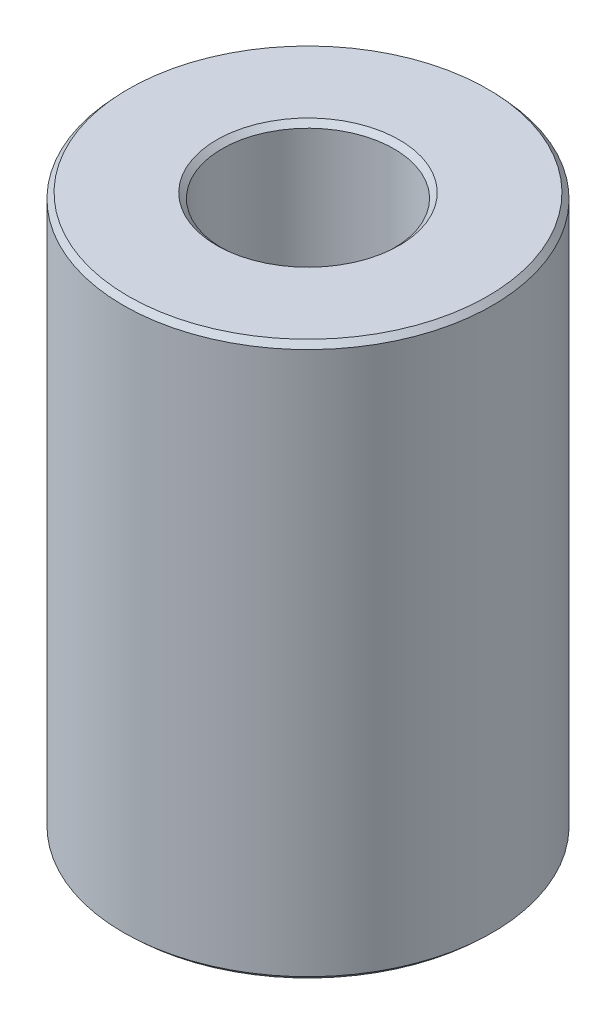
ISO-10303-21;
HEADER;
FILE_DESCRIPTION(('STEP AP214'),'2;1');
FILE_NAME('part.step','',(''),(''),'','','');
FILE_SCHEMA(('AUTOMOTIVE_DESIGN { 1 0 10303 214 1 1 1 1 }'));
ENDSEC;
DATA;
#1=APPLICATION_CONTEXT('core data for automotive mechanical design processes');
#2=APPLICATION_PROTOCOL_DEFINITION('international standard','automotive_design',2000,#1);
#3=PRODUCT_CONTEXT('',#1,'mechanical');
#4=PRODUCT('Part','Part','',(#3));
#5=PRODUCT_RELATED_PRODUCT_CATEGORY('part','',(#4));
#6=PRODUCT_DEFINITION_FORMATION('','',#4);
#7=PRODUCT_DEFINITION_CONTEXT('part definition',#1,'design');
#8=PRODUCT_DEFINITION('design','',#6,#7);
#9=PRODUCT_DEFINITION_SHAPE('','',#8);
#10=(LENGTH_UNIT() NAMED_UNIT(*) SI_UNIT(.MILLI.,.METRE.));
#11=(NAMED_UNIT(*) PLANE_ANGLE_UNIT() SI_UNIT($,.RADIAN.));
#12=(NAMED_UNIT(*) SI_UNIT($,.STERADIAN.) SOLID_ANGLE_UNIT());
#13=UNCERTAINTY_MEASURE_WITH_UNIT(LENGTH_MEASURE(1.E-05),#10,'distance_accuracy_value','');
#14=(GEOMETRIC_REPRESENTATION_CONTEXT(3) GLOBAL_UNCERTAINTY_ASSIGNED_CONTEXT((#13)) GLOBAL_UNIT_ASSIGNED_CONTEXT((#10,
#11,#12)) REPRESENTATION_CONTEXT('',''));
#15=CARTESIAN_POINT('',(0.,0.,0.));
#16=DIRECTION('',(0.,0.,1.));
#17=DIRECTION('',(1.,0.,0.));
#18=AXIS2_PLACEMENT_3D('',#15,#16,#17);
#19=CARTESIAN_POINT('',(0.,142.421724710952,0.));
#20=DIRECTION('',(0.,-1.,0.));
#21=DIRECTION('',(0.,0.,-1.));
#22=AXIS2_PLACEMENT_3D('',#19,#20,#21);
#23=CYLINDRICAL_SURFACE('',#22,47.5);
#24=CARTESIAN_POINT('',(0.,1.29029530972549,0.));
#25=DIRECTION('',(0.,1.,0.));
#26=DIRECTION('',(0.,0.,1.));
#27=AXIS2_PLACEMENT_3D('',#24,#25,#26);
#28=CIRCLE('',#27,47.5);
#29=CARTESIAN_POINT('',(0.,1.29029530972549,47.5));
#30=VERTEX_POINT('',#29);
#31=EDGE_CURVE('E10',#30,#30,#28,.T.);
#32=ORIENTED_EDGE('',*,*,#31,.T.);
#33=EDGE_LOOP('',(#32));
#34=FACE_BOUND('',#33,.T.);
#35=CARTESIAN_POINT('',(0.,141.028194066405,0.));
#36=DIRECTION('',(0.,1.,0.));
#37=DIRECTION('',(0.,0.,1.));
#38=AXIS2_PLACEMENT_3D('',#35,#36,#37);
#39=CIRCLE('',#38,47.5);
#40=CARTESIAN_POINT('',(0.,141.028194066405,47.5));
#41=VERTEX_POINT('',#40);
#42=EDGE_CURVE('E50',#41,#41,#39,.F.);
#43=ORIENTED_EDGE('',*,*,#42,.T.);
#44=EDGE_LOOP('',(#43));
#45=FACE_BOUND('',#44,.T.);
#46=ADVANCED_FACE('F39',(#34,#45),#23,.T.);
#47=CARTESIAN_POINT('',(0.,142.421724710952,0.));
#48=DIRECTION('',(0.,1.,0.));
#49=DIRECTION('',(0.,0.,1.));
#50=AXIS2_PLACEMENT_3D('',#47,#48,#49);
#51=PLANE('',#50);
#52=CARTESIAN_POINT('',(0.,142.421724710952,0.));
#53=DIRECTION('',(0.,1.,0.));
#54=DIRECTION('',(0.,0.,1.));
#55=AXIS2_PLACEMENT_3D('',#52,#53,#54);
#56=CIRCLE('',#55,23.5219155521721);
#57=CARTESIAN_POINT('',(0.,142.421724710952,23.5219155521721));
#58=VERTEX_POINT('',#57);
#59=EDGE_CURVE('E58',#58,#58,#56,.F.);
#60=ORIENTED_EDGE('',*,*,#59,.T.);
#61=EDGE_LOOP('',(#60));
#62=FACE_BOUND('',#61,.T.);
#63=CARTESIAN_POINT('',(0.,142.421724710952,0.));
#64=DIRECTION('',(0.,1.,0.));
#65=DIRECTION('',(0.,0.,1.));
#66=AXIS2_PLACEMENT_3D('',#63,#64,#65);
#67=CIRCLE('',#66,46.2097046902745);
#68=CARTESIAN_POINT('',(0.,142.421724710952,46.2097046902745));
#69=VERTEX_POINT('',#68);
#70=EDGE_CURVE('E61',#69,#69,#67,.T.);
#71=ORIENTED_EDGE('',*,*,#70,.T.);
#72=EDGE_LOOP('',(#71));
#73=FACE_BOUND('',#72,.T.);
#74=ADVANCED_FACE('F88',(#62,#73),#51,.T.);
#75=CARTESIAN_POINT('',(0.,0.,0.));
#76=DIRECTION('',(0.,1.,0.));
#77=DIRECTION('',(0.,0.,1.));
#78=AXIS2_PLACEMENT_3D('',#75,#76,#77);
#79=PLANE('',#78);
#80=CARTESIAN_POINT('',(0.,0.,0.));
#81=DIRECTION('',(0.,1.,0.));
#82=DIRECTION('',(0.,0.,1.));
#83=AXIS2_PLACEMENT_3D('',#80,#81,#82);
#84=CIRCLE('',#83,23.4186802173509);
#85=CARTESIAN_POINT('',(0.,0.,23.4186802173509));
#86=VERTEX_POINT('',#85);
#87=EDGE_CURVE('E51',#86,#86,#84,.T.);
#88=ORIENTED_EDGE('',*,*,#87,.T.);
#89=EDGE_LOOP('',(#88));
#90=FACE_BOUND('',#89,.T.);
#91=CARTESIAN_POINT('',(0.,0.,0.));
#92=DIRECTION('',(0.,1.,0.));
#93=DIRECTION('',(0.,0.,1.));
#94=AXIS2_PLACEMENT_3D('',#91,#92,#93);
#95=CIRCLE('',#94,46.1064693554533);
#96=CARTESIAN_POINT('',(0.,0.,46.1064693554533));
#97=VERTEX_POINT('',#96);
#98=EDGE_CURVE('E54',#97,#97,#95,.F.);
#99=ORIENTED_EDGE('',*,*,#98,.T.);
#100=EDGE_LOOP('',(#99));
#101=FACE_BOUND('',#100,.T.);
#102=ADVANCED_FACE('F83',(#90,#101),#79,.F.);
#103=CARTESIAN_POINT('',(0.,142.421724710952,0.));
#104=DIRECTION('',(0.,-1.,0.));
#105=DIRECTION('',(0.,0.,-1.));
#106=AXIS2_PLACEMENT_3D('',#103,#104,#105);
#107=CYLINDRICAL_SURFACE('',#106,22.1283849076254);
#108=CARTESIAN_POINT('',(0.,141.131429401226,0.));
#109=DIRECTION('',(0.,1.,0.));
#110=DIRECTION('',(0.,0.,1.));
#111=AXIS2_PLACEMENT_3D('',#108,#109,#110);
#112=CIRCLE('',#111,22.1283849076254);
#113=CARTESIAN_POINT('',(0.,141.131429401226,22.1283849076254));
#114=VERTEX_POINT('',#113);
#115=EDGE_CURVE('E67',#114,#114,#112,.T.);
#116=ORIENTED_EDGE('',*,*,#115,.T.);
#117=EDGE_LOOP('',(#116));
#118=FACE_BOUND('',#117,.T.);
#119=CARTESIAN_POINT('',(0.,1.3935306445467,0.));
#120=DIRECTION('',(0.,1.,0.));
#121=DIRECTION('',(0.,0.,1.));
#122=AXIS2_PLACEMENT_3D('',#119,#120,#121);
#123=CIRCLE('',#122,22.1283849076254);
#124=CARTESIAN_POINT('',(0.,1.3935306445467,22.1283849076254));
#125=VERTEX_POINT('',#124);
#126=EDGE_CURVE('E69',#125,#125,#123,.F.);
#127=ORIENTED_EDGE('',*,*,#126,.T.);
#128=EDGE_LOOP('',(#127));
#129=FACE_BOUND('',#128,.T.);
#130=ADVANCED_FACE('F71',(#118,#129),#107,.F.);
#131=CARTESIAN_POINT('',(0.,141.131429401226,0.));
#132=DIRECTION('',(0.,1.,0.));
#133=DIRECTION('',(0.,0.,1.));
#134=AXIS2_PLACEMENT_3D('',#131,#132,#133);
#135=CONICAL_SURFACE('',#134,22.1283849076254,0.823844942596162);
#136=ORIENTED_EDGE('',*,*,#59,.F.);
#137=EDGE_LOOP('',(#136));
#138=FACE_BOUND('',#137,.T.);
#139=ORIENTED_EDGE('',*,*,#115,.F.);
#140=EDGE_LOOP('',(#139));
#141=FACE_BOUND('',#140,.T.);
#142=ADVANCED_FACE('F77',(#138,#141),#135,.F.);
#143=CARTESIAN_POINT('',(0.,0.,0.));
#144=DIRECTION('',(0.,-1.,0.));
#145=DIRECTION('',(0.,0.,-1.));
#146=AXIS2_PLACEMENT_3D('',#143,#144,#145);
#147=CONICAL_SURFACE('',#146,23.4186802173509,0.746951384198719);
#148=ORIENTED_EDGE('',*,*,#126,.F.);
#149=EDGE_LOOP('',(#148));
#150=FACE_BOUND('',#149,.T.);
#151=ORIENTED_EDGE('',*,*,#87,.F.);
#152=EDGE_LOOP('',(#151));
#153=FACE_BOUND('',#152,.T.);
#154=ADVANCED_FACE('F73',(#150,#153),#147,.F.);
#155=CARTESIAN_POINT('',(0.,1.29029530972549,0.));
#156=DIRECTION('',(0.,1.,0.));
#157=DIRECTION('',(0.,0.,1.));
#158=AXIS2_PLACEMENT_3D('',#155,#156,#157);
#159=CONICAL_SURFACE('',#158,47.5,0.823844942596165);
#160=ORIENTED_EDGE('',*,*,#98,.F.);
#161=EDGE_LOOP('',(#160));
#162=FACE_BOUND('',#161,.T.);
#163=ORIENTED_EDGE('',*,*,#31,.F.);
#164=EDGE_LOOP('',(#163));
#165=FACE_BOUND('',#164,.T.);
#166=ADVANCED_FACE('F76',(#162,#165),#159,.T.);
#167=CARTESIAN_POINT('',(0.,142.421724710952,0.));
#168=DIRECTION('',(0.,-1.,0.));
#169=DIRECTION('',(0.,0.,-1.));
#170=AXIS2_PLACEMENT_3D('',#167,#168,#169);
#171=CONICAL_SURFACE('',#170,46.2097046902745,0.746951384198728);
#172=ORIENTED_EDGE('',*,*,#42,.F.);
#173=EDGE_LOOP('',(#172));
#174=FACE_BOUND('',#173,.T.);
#175=ORIENTED_EDGE('',*,*,#70,.F.);
#176=EDGE_LOOP('',(#175));
#177=FACE_BOUND('',#176,.T.);
#178=ADVANCED_FACE('F45',(#174,#177),#171,.T.);
#179=CLOSED_SHELL('',(#46,#74,#102,#130,#142,#154,#166,#178));
#180=MANIFOLD_SOLID_BREP('B2',#179);
#181=ADVANCED_BREP_SHAPE_REPRESENTATION('',(#18,#180),#14);
#182=SHAPE_DEFINITION_REPRESENTATION(#9,#181);
ENDSEC;
END-ISO-10303-21;
